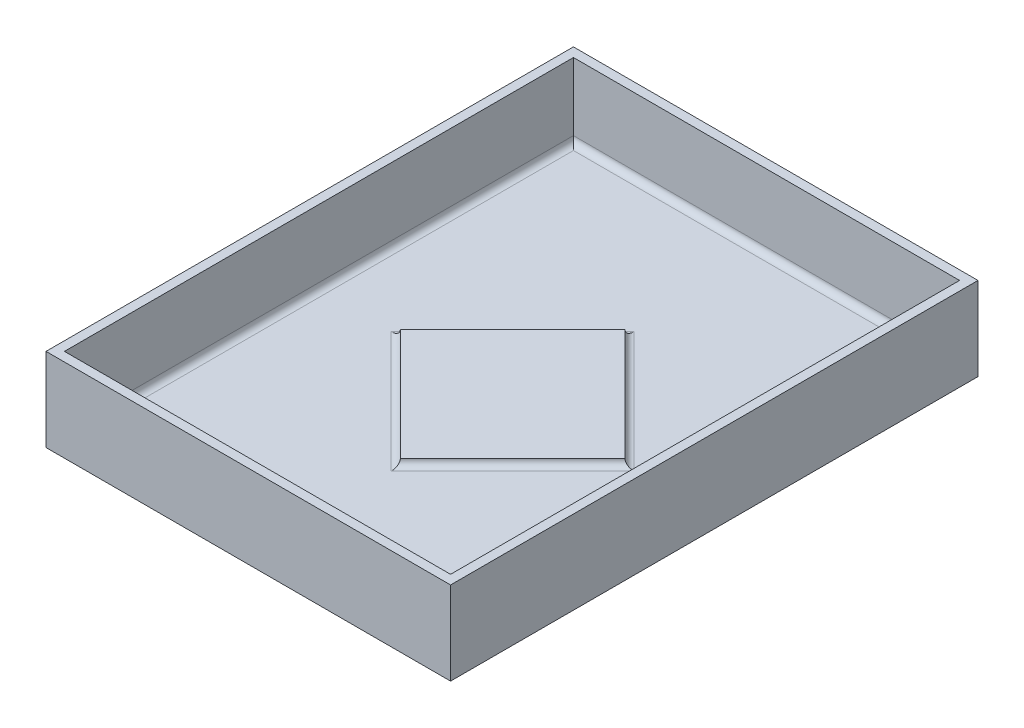
ISO-10303-21;
HEADER;
FILE_DESCRIPTION(('STEP AP214'),'2;1');
FILE_NAME('part.step','',(''),(''),'','','');
FILE_SCHEMA(('AUTOMOTIVE_DESIGN { 1 0 10303 214 1 1 1 1 }'));
ENDSEC;
DATA;
#1=APPLICATION_CONTEXT('core data for automotive mechanical design processes');
#2=APPLICATION_PROTOCOL_DEFINITION('international standard','automotive_design',2000,#1);
#3=PRODUCT_CONTEXT('',#1,'mechanical');
#4=PRODUCT('Part','Part','',(#3));
#5=PRODUCT_RELATED_PRODUCT_CATEGORY('part','',(#4));
#6=PRODUCT_DEFINITION_FORMATION('','',#4);
#7=PRODUCT_DEFINITION_CONTEXT('part definition',#1,'design');
#8=PRODUCT_DEFINITION('design','',#6,#7);
#9=PRODUCT_DEFINITION_SHAPE('','',#8);
#10=(LENGTH_UNIT() NAMED_UNIT(*) SI_UNIT(.MILLI.,.METRE.));
#11=(NAMED_UNIT(*) PLANE_ANGLE_UNIT() SI_UNIT($,.RADIAN.));
#12=(NAMED_UNIT(*) SI_UNIT($,.STERADIAN.) SOLID_ANGLE_UNIT());
#13=UNCERTAINTY_MEASURE_WITH_UNIT(LENGTH_MEASURE(1.E-05),#10,'distance_accuracy_value','');
#14=(GEOMETRIC_REPRESENTATION_CONTEXT(3) GLOBAL_UNCERTAINTY_ASSIGNED_CONTEXT((#13)) GLOBAL_UNIT_ASSIGNED_CONTEXT((#10,
#11,#12)) REPRESENTATION_CONTEXT('',''));
#15=CARTESIAN_POINT('',(0.,0.,0.));
#16=DIRECTION('',(0.,0.,1.));
#17=DIRECTION('',(1.,0.,0.));
#18=AXIS2_PLACEMENT_3D('',#15,#16,#17);
#19=CARTESIAN_POINT('',(0.,0.,0.));
#20=DIRECTION('',(0.,1.,0.));
#21=DIRECTION('',(0.,0.,1.));
#22=AXIS2_PLACEMENT_3D('',#19,#20,#21);
#23=PLANE('',#22);
#24=DIRECTION('',(-0.707106781186547,0.,-0.707106781186548));
#25=VECTOR('',#24,1.);
#26=CARTESIAN_POINT('',(309.126078517512,0.,-309.126078517512));
#27=LINE('',#26,#25);
#28=CARTESIAN_POINT('',(210.222102231989,0.,-408.030054803034));
#29=VERTEX_POINT('',#28);
#30=CARTESIAN_POINT('',(341.355054803034,0.,-276.897102231989));
#31=VERTEX_POINT('',#30);
#32=EDGE_CURVE('E242',#29,#31,#27,.F.);
#33=ORIENTED_EDGE('',*,*,#32,.T.);
#34=DIRECTION('',(0.707106781186547,0.,-0.707106781186548));
#35=VECTOR('',#34,1.);
#36=CARTESIAN_POINT('',(32.2289762855227,0.,32.2289762855226));
#37=LINE('',#36,#35);
#38=CARTESIAN_POINT('',(209.55,0.,-145.092047428955));
#39=VERTEX_POINT('',#38);
#40=EDGE_CURVE('E244',#31,#39,#37,.F.);
#41=ORIENTED_EDGE('',*,*,#40,.T.);
#42=DIRECTION('',(0.707106781186547,0.,0.707106781186548));
#43=VECTOR('',#42,1.);
#44=CARTESIAN_POINT('',(177.321023714477,0.,-177.321023714477));
#45=LINE('',#44,#43);
#46=CARTESIAN_POINT('',(78.4170474289547,0.,-276.225));
#47=VERTEX_POINT('',#46);
#48=EDGE_CURVE('E238',#39,#47,#45,.F.);
#49=ORIENTED_EDGE('',*,*,#48,.T.);
#50=DIRECTION('',(-0.707106781186547,0.,0.707106781186548));
#51=VECTOR('',#50,1.);
#52=CARTESIAN_POINT('',(-98.9039762855226,0.,-98.9039762855226));
#53=LINE('',#52,#51);
#54=EDGE_CURVE('E240',#47,#29,#53,.F.);
#55=ORIENTED_EDGE('',*,*,#54,.T.);
#56=EDGE_LOOP('',(#33,#41,#49,#55));
#57=FACE_BOUND('',#56,.T.);
#58=DIRECTION('',(1.,0.,0.));
#59=VECTOR('',#58,1.);
#60=CARTESIAN_POINT('',(419.1,0.,-7.));
#61=LINE('',#60,#59);
#62=CARTESIAN_POINT('',(7.,0.,-7.));
#63=VERTEX_POINT('',#62);
#64=CARTESIAN_POINT('',(412.1,0.,-7.));
#65=VERTEX_POINT('',#64);
#66=EDGE_CURVE('E233',#63,#65,#61,.T.);
#67=ORIENTED_EDGE('',*,*,#66,.T.);
#68=DIRECTION('',(0.,0.,-1.));
#69=VECTOR('',#68,1.);
#70=CARTESIAN_POINT('',(412.1,0.,-552.45));
#71=LINE('',#70,#69);
#72=CARTESIAN_POINT('',(412.1,0.,-545.45));
#73=VERTEX_POINT('',#72);
#74=EDGE_CURVE('E235',#65,#73,#71,.T.);
#75=ORIENTED_EDGE('',*,*,#74,.T.);
#76=DIRECTION('',(-1.,0.,0.));
#77=VECTOR('',#76,1.);
#78=CARTESIAN_POINT('',(0.,0.,-545.45));
#79=LINE('',#78,#77);
#80=CARTESIAN_POINT('',(7.,0.,-545.45));
#81=VERTEX_POINT('',#80);
#82=EDGE_CURVE('E229',#73,#81,#79,.T.);
#83=ORIENTED_EDGE('',*,*,#82,.T.);
#84=DIRECTION('',(0.,0.,1.));
#85=VECTOR('',#84,1.);
#86=CARTESIAN_POINT('',(7.,0.,0.));
#87=LINE('',#86,#85);
#88=EDGE_CURVE('E231',#81,#63,#87,.T.);
#89=ORIENTED_EDGE('',*,*,#88,.T.);
#90=EDGE_LOOP('',(#67,#75,#83,#89));
#91=FACE_BOUND('',#90,.T.);
#92=ADVANCED_FACE('F33',(#57,#91),#23,.T.);
#93=CARTESIAN_POINT('',(0.,80.42,0.));
#94=DIRECTION('',(0.,1.,0.));
#95=DIRECTION('',(0.,0.,1.));
#96=AXIS2_PLACEMENT_3D('',#93,#94,#95);
#97=PLANE('',#96);
#98=DIRECTION('',(0.,0.,1.));
#99=VECTOR('',#98,1.);
#100=CARTESIAN_POINT('',(-10.0000000000001,80.42,-562.45));
#101=LINE('',#100,#99);
#102=CARTESIAN_POINT('',(-10.0000000000001,80.42,-562.45));
#103=VERTEX_POINT('',#102);
#104=CARTESIAN_POINT('',(-10.,80.42,10.));
#105=VERTEX_POINT('',#104);
#106=EDGE_CURVE('E209',#103,#105,#101,.T.);
#107=ORIENTED_EDGE('',*,*,#106,.T.);
#108=DIRECTION('',(1.,0.,0.));
#109=VECTOR('',#108,1.);
#110=CARTESIAN_POINT('',(-10.,80.42,10.));
#111=LINE('',#110,#109);
#112=CARTESIAN_POINT('',(429.1,80.42,10.));
#113=VERTEX_POINT('',#112);
#114=EDGE_CURVE('E212',#105,#113,#111,.T.);
#115=ORIENTED_EDGE('',*,*,#114,.T.);
#116=DIRECTION('',(0.,0.,-1.));
#117=VECTOR('',#116,1.);
#118=CARTESIAN_POINT('',(429.1,80.42,-562.45));
#119=LINE('',#118,#117);
#120=CARTESIAN_POINT('',(429.1,80.42,-562.45));
#121=VERTEX_POINT('',#120);
#122=EDGE_CURVE('E214',#113,#121,#119,.T.);
#123=ORIENTED_EDGE('',*,*,#122,.T.);
#124=DIRECTION('',(-1.,0.,0.));
#125=VECTOR('',#124,1.);
#126=CARTESIAN_POINT('',(-10.0000000000001,80.42,-562.45));
#127=LINE('',#126,#125);
#128=EDGE_CURVE('E216',#121,#103,#127,.T.);
#129=ORIENTED_EDGE('',*,*,#128,.T.);
#130=EDGE_LOOP('',(#107,#115,#123,#129));
#131=FACE_BOUND('',#130,.T.);
#132=DIRECTION('',(1.,0.,0.));
#133=VECTOR('',#132,1.);
#134=CARTESIAN_POINT('',(0.,80.42,0.));
#135=LINE('',#134,#133);
#136=CARTESIAN_POINT('',(0.,80.42,0.));
#137=VERTEX_POINT('',#136);
#138=CARTESIAN_POINT('',(419.1,80.42,0.));
#139=VERTEX_POINT('',#138);
#140=EDGE_CURVE('E193',#137,#139,#135,.T.);
#141=ORIENTED_EDGE('',*,*,#140,.F.);
#142=DIRECTION('',(0.,0.,1.));
#143=VECTOR('',#142,1.);
#144=CARTESIAN_POINT('',(0.,80.42,-552.45));
#145=LINE('',#144,#143);
#146=CARTESIAN_POINT('',(0.,80.42,-552.45));
#147=VERTEX_POINT('',#146);
#148=EDGE_CURVE('E191',#147,#137,#145,.T.);
#149=ORIENTED_EDGE('',*,*,#148,.F.);
#150=DIRECTION('',(-1.,0.,0.));
#151=VECTOR('',#150,1.);
#152=CARTESIAN_POINT('',(0.,80.42,-552.45));
#153=LINE('',#152,#151);
#154=CARTESIAN_POINT('',(419.1,80.42,-552.45));
#155=VERTEX_POINT('',#154);
#156=EDGE_CURVE('E198',#155,#147,#153,.T.);
#157=ORIENTED_EDGE('',*,*,#156,.F.);
#158=DIRECTION('',(0.,0.,-1.));
#159=VECTOR('',#158,1.);
#160=CARTESIAN_POINT('',(419.1,80.42,-552.45));
#161=LINE('',#160,#159);
#162=EDGE_CURVE('E195',#139,#155,#161,.T.);
#163=ORIENTED_EDGE('',*,*,#162,.F.);
#164=EDGE_LOOP('',(#141,#149,#157,#163));
#165=FACE_BOUND('',#164,.T.);
#166=ADVANCED_FACE('F298',(#131,#165),#97,.T.);
#167=CARTESIAN_POINT('',(-10.0000000000001,80.42,-562.45));
#168=DIRECTION('',(1.,0.,0.));
#169=DIRECTION('',(0.,0.,-1.));
#170=AXIS2_PLACEMENT_3D('',#167,#168,#169);
#171=PLANE('',#170);
#172=DIRECTION('',(0.,-1.,0.));
#173=VECTOR('',#172,1.);
#174=CARTESIAN_POINT('',(-10.0000000000001,80.42,-562.45));
#175=LINE('',#174,#173);
#176=CARTESIAN_POINT('',(-10.0000000000001,-10.,-562.45));
#177=VERTEX_POINT('',#176);
#178=EDGE_CURVE('E218',#103,#177,#175,.T.);
#179=ORIENTED_EDGE('',*,*,#178,.T.);
#180=DIRECTION('',(0.,0.,1.));
#181=VECTOR('',#180,1.);
#182=CARTESIAN_POINT('',(-10.0000000000001,-10.,10.));
#183=LINE('',#182,#181);
#184=CARTESIAN_POINT('',(-10.0000000000001,-10.,10.));
#185=VERTEX_POINT('',#184);
#186=EDGE_CURVE('E185',#177,#185,#183,.T.);
#187=ORIENTED_EDGE('',*,*,#186,.T.);
#188=DIRECTION('',(0.,-1.,0.));
#189=VECTOR('',#188,1.);
#190=CARTESIAN_POINT('',(-10.,80.42,10.));
#191=LINE('',#190,#189);
#192=EDGE_CURVE('E224',#105,#185,#191,.T.);
#193=ORIENTED_EDGE('',*,*,#192,.F.);
#194=ORIENTED_EDGE('',*,*,#106,.F.);
#195=EDGE_LOOP('',(#179,#187,#193,#194));
#196=FACE_BOUND('',#195,.T.);
#197=ADVANCED_FACE('F304',(#196),#171,.F.);
#198=CARTESIAN_POINT('',(-10.,80.42,10.));
#199=DIRECTION('',(0.,0.,-1.));
#200=DIRECTION('',(-1.,0.,0.));
#201=AXIS2_PLACEMENT_3D('',#198,#199,#200);
#202=PLANE('',#201);
#203=ORIENTED_EDGE('',*,*,#192,.T.);
#204=DIRECTION('',(1.,0.,0.));
#205=VECTOR('',#204,1.);
#206=CARTESIAN_POINT('',(429.1,-10.,10.));
#207=LINE('',#206,#205);
#208=CARTESIAN_POINT('',(429.1,-10.,10.));
#209=VERTEX_POINT('',#208);
#210=EDGE_CURVE('E188',#185,#209,#207,.T.);
#211=ORIENTED_EDGE('',*,*,#210,.T.);
#212=DIRECTION('',(0.,-1.,0.));
#213=VECTOR('',#212,1.);
#214=CARTESIAN_POINT('',(429.1,80.42,10.));
#215=LINE('',#214,#213);
#216=EDGE_CURVE('E222',#113,#209,#215,.T.);
#217=ORIENTED_EDGE('',*,*,#216,.F.);
#218=ORIENTED_EDGE('',*,*,#114,.F.);
#219=EDGE_LOOP('',(#203,#211,#217,#218));
#220=FACE_BOUND('',#219,.T.);
#221=ADVANCED_FACE('F328',(#220),#202,.F.);
#222=CARTESIAN_POINT('',(429.1,80.42,-562.45));
#223=DIRECTION('',(-1.,0.,0.));
#224=DIRECTION('',(0.,0.,1.));
#225=AXIS2_PLACEMENT_3D('',#222,#223,#224);
#226=PLANE('',#225);
#227=ORIENTED_EDGE('',*,*,#216,.T.);
#228=DIRECTION('',(0.,0.,-1.));
#229=VECTOR('',#228,1.);
#230=CARTESIAN_POINT('',(429.1,-10.,10.));
#231=LINE('',#230,#229);
#232=CARTESIAN_POINT('',(429.1,-10.,-562.45));
#233=VERTEX_POINT('',#232);
#234=EDGE_CURVE('E174',#209,#233,#231,.T.);
#235=ORIENTED_EDGE('',*,*,#234,.T.);
#236=DIRECTION('',(0.,-1.,0.));
#237=VECTOR('',#236,1.);
#238=CARTESIAN_POINT('',(429.1,80.42,-562.45));
#239=LINE('',#238,#237);
#240=EDGE_CURVE('E220',#121,#233,#239,.T.);
#241=ORIENTED_EDGE('',*,*,#240,.F.);
#242=ORIENTED_EDGE('',*,*,#122,.F.);
#243=EDGE_LOOP('',(#227,#235,#241,#242));
#244=FACE_BOUND('',#243,.T.);
#245=ADVANCED_FACE('F324',(#244),#226,.F.);
#246=CARTESIAN_POINT('',(-10.0000000000001,80.42,-562.45));
#247=DIRECTION('',(0.,0.,1.));
#248=DIRECTION('',(1.,0.,0.));
#249=AXIS2_PLACEMENT_3D('',#246,#247,#248);
#250=PLANE('',#249);
#251=ORIENTED_EDGE('',*,*,#240,.T.);
#252=DIRECTION('',(-1.,0.,0.));
#253=VECTOR('',#252,1.);
#254=CARTESIAN_POINT('',(429.1,-10.,-562.45));
#255=LINE('',#254,#253);
#256=EDGE_CURVE('E177',#233,#177,#255,.T.);
#257=ORIENTED_EDGE('',*,*,#256,.T.);
#258=ORIENTED_EDGE('',*,*,#178,.F.);
#259=ORIENTED_EDGE('',*,*,#128,.F.);
#260=EDGE_LOOP('',(#251,#257,#258,#259));
#261=FACE_BOUND('',#260,.T.);
#262=ADVANCED_FACE('F320',(#261),#250,.F.);
#263=CARTESIAN_POINT('',(0.,80.42,-552.45));
#264=DIRECTION('',(1.,0.,0.));
#265=DIRECTION('',(0.,0.,-1.));
#266=AXIS2_PLACEMENT_3D('',#263,#264,#265);
#267=PLANE('',#266);
#268=DIRECTION('',(0.,-1.,0.));
#269=VECTOR('',#268,1.);
#270=CARTESIAN_POINT('',(0.,80.42,0.));
#271=LINE('',#270,#269);
#272=CARTESIAN_POINT('',(0.,6.99999999999999,0.));
#273=VERTEX_POINT('',#272);
#274=EDGE_CURVE('E207',#137,#273,#271,.T.);
#275=ORIENTED_EDGE('',*,*,#274,.T.);
#276=DIRECTION('',(0.,0.,1.));
#277=VECTOR('',#276,1.);
#278=CARTESIAN_POINT('',(0.,7.,-552.45));
#279=LINE('',#278,#277);
#280=CARTESIAN_POINT('',(0.,6.99999999999999,-552.45));
#281=VERTEX_POINT('',#280);
#282=EDGE_CURVE('E42',#273,#281,#279,.F.);
#283=ORIENTED_EDGE('',*,*,#282,.T.);
#284=DIRECTION('',(0.,-1.,0.));
#285=VECTOR('',#284,1.);
#286=CARTESIAN_POINT('',(0.,80.42,-552.45));
#287=LINE('',#286,#285);
#288=EDGE_CURVE('E200',#147,#281,#287,.T.);
#289=ORIENTED_EDGE('',*,*,#288,.F.);
#290=ORIENTED_EDGE('',*,*,#148,.T.);
#291=EDGE_LOOP('',(#275,#283,#289,#290));
#292=FACE_BOUND('',#291,.T.);
#293=ADVANCED_FACE('F318',(#292),#267,.T.);
#294=CARTESIAN_POINT('',(0.,80.42,0.));
#295=DIRECTION('',(0.,0.,-1.));
#296=DIRECTION('',(-1.,0.,0.));
#297=AXIS2_PLACEMENT_3D('',#294,#295,#296);
#298=PLANE('',#297);
#299=DIRECTION('',(0.,-1.,0.));
#300=VECTOR('',#299,1.);
#301=CARTESIAN_POINT('',(419.1,80.42,0.));
#302=LINE('',#301,#300);
#303=CARTESIAN_POINT('',(419.1,6.99999999999999,0.));
#304=VERTEX_POINT('',#303);
#305=EDGE_CURVE('E205',#139,#304,#302,.T.);
#306=ORIENTED_EDGE('',*,*,#305,.T.);
#307=DIRECTION('',(1.,0.,0.));
#308=VECTOR('',#307,1.);
#309=CARTESIAN_POINT('',(0.,7.,0.));
#310=LINE('',#309,#308);
#311=EDGE_CURVE('E57',#304,#273,#310,.F.);
#312=ORIENTED_EDGE('',*,*,#311,.T.);
#313=ORIENTED_EDGE('',*,*,#274,.F.);
#314=ORIENTED_EDGE('',*,*,#140,.T.);
#315=EDGE_LOOP('',(#306,#312,#313,#314));
#316=FACE_BOUND('',#315,.T.);
#317=ADVANCED_FACE('F315',(#316),#298,.T.);
#318=CARTESIAN_POINT('',(419.1,80.42,-552.45));
#319=DIRECTION('',(-1.,0.,0.));
#320=DIRECTION('',(0.,0.,1.));
#321=AXIS2_PLACEMENT_3D('',#318,#319,#320);
#322=PLANE('',#321);
#323=DIRECTION('',(0.,-1.,0.));
#324=VECTOR('',#323,1.);
#325=CARTESIAN_POINT('',(419.1,80.42,-552.45));
#326=LINE('',#325,#324);
#327=CARTESIAN_POINT('',(419.1,6.99999999999999,-552.45));
#328=VERTEX_POINT('',#327);
#329=EDGE_CURVE('E202',#155,#328,#326,.T.);
#330=ORIENTED_EDGE('',*,*,#329,.T.);
#331=DIRECTION('',(0.,0.,-1.));
#332=VECTOR('',#331,1.);
#333=CARTESIAN_POINT('',(419.1,7.,0.));
#334=LINE('',#333,#332);
#335=EDGE_CURVE('E252',#328,#304,#334,.F.);
#336=ORIENTED_EDGE('',*,*,#335,.T.);
#337=ORIENTED_EDGE('',*,*,#305,.F.);
#338=ORIENTED_EDGE('',*,*,#162,.T.);
#339=EDGE_LOOP('',(#330,#336,#337,#338));
#340=FACE_BOUND('',#339,.T.);
#341=ADVANCED_FACE('F289',(#340),#322,.T.);
#342=CARTESIAN_POINT('',(0.,80.42,-552.45));
#343=DIRECTION('',(0.,0.,1.));
#344=DIRECTION('',(1.,0.,0.));
#345=AXIS2_PLACEMENT_3D('',#342,#343,#344);
#346=PLANE('',#345);
#347=ORIENTED_EDGE('',*,*,#288,.T.);
#348=DIRECTION('',(-1.,0.,0.));
#349=VECTOR('',#348,1.);
#350=CARTESIAN_POINT('',(419.1,7.,-552.45));
#351=LINE('',#350,#349);
#352=EDGE_CURVE('E11',#281,#328,#351,.F.);
#353=ORIENTED_EDGE('',*,*,#352,.T.);
#354=ORIENTED_EDGE('',*,*,#329,.F.);
#355=ORIENTED_EDGE('',*,*,#156,.T.);
#356=EDGE_LOOP('',(#347,#353,#354,#355));
#357=FACE_BOUND('',#356,.T.);
#358=ADVANCED_FACE('F286',(#357),#346,.T.);
#359=CARTESIAN_POINT('',(0.,-10.,0.));
#360=DIRECTION('',(0.,1.,0.));
#361=DIRECTION('',(0.,0.,1.));
#362=AXIS2_PLACEMENT_3D('',#359,#360,#361);
#363=PLANE('',#362);
#364=ORIENTED_EDGE('',*,*,#234,.F.);
#365=ORIENTED_EDGE('',*,*,#210,.F.);
#366=ORIENTED_EDGE('',*,*,#186,.F.);
#367=ORIENTED_EDGE('',*,*,#256,.F.);
#368=EDGE_LOOP('',(#364,#365,#366,#367));
#369=FACE_BOUND('',#368,.T.);
#370=ADVANCED_FACE('F309',(#369),#363,.F.);
#371=CARTESIAN_POINT('',(88.3165423655664,7.16,-276.225));
#372=DIRECTION('',(0.707106781186548,0.,0.707106781186547));
#373=DIRECTION('',(0.707106781186547,0.,-0.707106781186548));
#374=AXIS2_PLACEMENT_3D('',#371,#372,#373);
#375=PLANE('',#374);
#376=DIRECTION('',(0.,-1.,0.));
#377=VECTOR('',#376,1.);
#378=CARTESIAN_POINT('',(210.222102231989,7.16,-398.130559866423));
#379=LINE('',#378,#377);
#380=CARTESIAN_POINT('',(210.222102231989,7.16,-398.130559866423));
#381=VERTEX_POINT('',#380);
#382=CARTESIAN_POINT('',(210.222102231989,7.,-398.130559866423));
#383=VERTEX_POINT('',#382);
#384=EDGE_CURVE('E551',#381,#383,#379,.T.);
#385=ORIENTED_EDGE('',*,*,#384,.T.);
#386=DIRECTION('',(-0.707106781186547,0.,0.707106781186548));
#387=VECTOR('',#386,1.);
#388=CARTESIAN_POINT('',(88.3165423655664,7.,-276.225));
#389=LINE('',#388,#387);
#390=CARTESIAN_POINT('',(88.3165423655664,7.,-276.225));
#391=VERTEX_POINT('',#390);
#392=EDGE_CURVE('E173',#383,#391,#389,.T.);
#393=ORIENTED_EDGE('',*,*,#392,.T.);
#394=DIRECTION('',(0.,-1.,0.));
#395=VECTOR('',#394,1.);
#396=CARTESIAN_POINT('',(88.3165423655664,7.16,-276.225));
#397=LINE('',#396,#395);
#398=CARTESIAN_POINT('',(88.3165423655664,7.16,-276.225));
#399=VERTEX_POINT('',#398);
#400=EDGE_CURVE('E153',#399,#391,#397,.T.);
#401=ORIENTED_EDGE('',*,*,#400,.F.);
#402=DIRECTION('',(-0.707106781186547,0.,0.707106781186548));
#403=VECTOR('',#402,1.);
#404=CARTESIAN_POINT('',(88.3165423655664,7.16,-276.225));
#405=LINE('',#404,#403);
#406=EDGE_CURVE('E160',#381,#399,#405,.T.);
#407=ORIENTED_EDGE('',*,*,#406,.F.);
#408=EDGE_LOOP('',(#385,#393,#401,#407));
#409=FACE_BOUND('',#408,.T.);
#410=ADVANCED_FACE('F171',(#409),#375,.F.);
#411=CARTESIAN_POINT('',(88.3165423655664,7.16,-276.225));
#412=DIRECTION('',(0.707106781186548,0.,-0.707106781186547));
#413=DIRECTION('',(-0.707106781186547,0.,-0.707106781186548));
#414=AXIS2_PLACEMENT_3D('',#411,#412,#413);
#415=PLANE('',#414);
#416=ORIENTED_EDGE('',*,*,#400,.T.);
#417=DIRECTION('',(0.707106781186547,0.,0.707106781186548));
#418=VECTOR('',#417,1.);
#419=CARTESIAN_POINT('',(88.3165423655664,7.,-276.225));
#420=LINE('',#419,#418);
#421=CARTESIAN_POINT('',(209.55,7.,-154.991542365566));
#422=VERTEX_POINT('',#421);
#423=EDGE_CURVE('E250',#391,#422,#420,.T.);
#424=ORIENTED_EDGE('',*,*,#423,.T.);
#425=DIRECTION('',(0.,-1.,0.));
#426=VECTOR('',#425,1.);
#427=CARTESIAN_POINT('',(209.55,7.16,-154.991542365566));
#428=LINE('',#427,#426);
#429=CARTESIAN_POINT('',(209.55,7.16,-154.991542365566));
#430=VERTEX_POINT('',#429);
#431=EDGE_CURVE('E156',#430,#422,#428,.T.);
#432=ORIENTED_EDGE('',*,*,#431,.F.);
#433=DIRECTION('',(0.707106781186547,0.,0.707106781186548));
#434=VECTOR('',#433,1.);
#435=CARTESIAN_POINT('',(88.3165423655664,7.16,-276.225));
#436=LINE('',#435,#434);
#437=EDGE_CURVE('E149',#399,#430,#436,.T.);
#438=ORIENTED_EDGE('',*,*,#437,.F.);
#439=EDGE_LOOP('',(#416,#424,#432,#438));
#440=FACE_BOUND('',#439,.T.);
#441=ADVANCED_FACE('F151',(#440),#415,.F.);
#442=CARTESIAN_POINT('',(209.55,7.16,-154.991542365566));
#443=DIRECTION('',(-0.707106781186548,0.,-0.707106781186547));
#444=DIRECTION('',(-0.707106781186547,0.,0.707106781186548));
#445=AXIS2_PLACEMENT_3D('',#442,#443,#444);
#446=PLANE('',#445);
#447=ORIENTED_EDGE('',*,*,#431,.T.);
#448=DIRECTION('',(0.707106781186547,0.,-0.707106781186548));
#449=VECTOR('',#448,1.);
#450=CARTESIAN_POINT('',(209.55,7.,-154.991542365566));
#451=LINE('',#450,#449);
#452=CARTESIAN_POINT('',(331.455559866423,7.,-276.897102231989));
#453=VERTEX_POINT('',#452);
#454=EDGE_CURVE('E226',#422,#453,#451,.T.);
#455=ORIENTED_EDGE('',*,*,#454,.T.);
#456=DIRECTION('',(0.,-1.,0.));
#457=VECTOR('',#456,1.);
#458=CARTESIAN_POINT('',(331.455559866423,7.16,-276.897102231989));
#459=LINE('',#458,#457);
#460=CARTESIAN_POINT('',(331.455559866423,7.16,-276.897102231989));
#461=VERTEX_POINT('',#460);
#462=EDGE_CURVE('E179',#461,#453,#459,.T.);
#463=ORIENTED_EDGE('',*,*,#462,.F.);
#464=DIRECTION('',(0.707106781186547,0.,-0.707106781186548));
#465=VECTOR('',#464,1.);
#466=CARTESIAN_POINT('',(209.55,7.16,-154.991542365566));
#467=LINE('',#466,#465);
#468=EDGE_CURVE('E159',#430,#461,#467,.T.);
#469=ORIENTED_EDGE('',*,*,#468,.F.);
#470=EDGE_LOOP('',(#447,#455,#463,#469));
#471=FACE_BOUND('',#470,.T.);
#472=ADVANCED_FACE('F391',(#471),#446,.F.);
#473=CARTESIAN_POINT('',(210.222102231989,7.16,-398.130559866423));
#474=DIRECTION('',(-0.707106781186548,0.,0.707106781186547));
#475=DIRECTION('',(0.707106781186547,0.,0.707106781186548));
#476=AXIS2_PLACEMENT_3D('',#473,#474,#475);
#477=PLANE('',#476);
#478=ORIENTED_EDGE('',*,*,#462,.T.);
#479=DIRECTION('',(-0.707106781186547,0.,-0.707106781186548));
#480=VECTOR('',#479,1.);
#481=CARTESIAN_POINT('',(210.222102231989,7.,-398.130559866423));
#482=LINE('',#481,#480);
#483=EDGE_CURVE('E247',#453,#383,#482,.T.);
#484=ORIENTED_EDGE('',*,*,#483,.T.);
#485=ORIENTED_EDGE('',*,*,#384,.F.);
#486=DIRECTION('',(-0.707106781186547,0.,-0.707106781186548));
#487=VECTOR('',#486,1.);
#488=CARTESIAN_POINT('',(210.222102231989,7.16,-398.130559866423));
#489=LINE('',#488,#487);
#490=EDGE_CURVE('E165',#461,#381,#489,.T.);
#491=ORIENTED_EDGE('',*,*,#490,.F.);
#492=EDGE_LOOP('',(#478,#484,#485,#491));
#493=FACE_BOUND('',#492,.T.);
#494=ADVANCED_FACE('F384',(#493),#477,.F.);
#495=CARTESIAN_POINT('',(0.,7.16,0.));
#496=DIRECTION('',(0.,-1.,0.));
#497=DIRECTION('',(0.,0.,-1.));
#498=AXIS2_PLACEMENT_3D('',#495,#496,#497);
#499=PLANE('',#498);
#500=ORIENTED_EDGE('',*,*,#406,.T.);
#501=ORIENTED_EDGE('',*,*,#437,.T.);
#502=ORIENTED_EDGE('',*,*,#468,.T.);
#503=ORIENTED_EDGE('',*,*,#490,.T.);
#504=EDGE_LOOP('',(#500,#501,#502,#503));
#505=FACE_BOUND('',#504,.T.);
#506=ADVANCED_FACE('F163',(#505),#499,.F.);
#507=CARTESIAN_POINT('',(83.3667948972606,7.,-281.174747468306));
#508=DIRECTION('',(-0.707106781186547,0.,0.707106781186548));
#509=DIRECTION('',(0.707106781186548,0.,0.707106781186547));
#510=AXIS2_PLACEMENT_3D('',#507,#508,#509);
#511=CYLINDRICAL_SURFACE('',#510,7.);
#512=CARTESIAN_POINT('',(210.222102231989,7.,-408.030054803034));
#513=DIRECTION('',(-1.,0.,0.));
#514=DIRECTION('',(0.,0.,1.));
#515=AXIS2_PLACEMENT_3D('',#512,#513,#514);
#516=ELLIPSE('',#515,9.89949493661167,7.);
#517=EDGE_CURVE('E261',#29,#383,#516,.T.);
#518=ORIENTED_EDGE('',*,*,#517,.F.);
#519=ORIENTED_EDGE('',*,*,#54,.F.);
#520=CARTESIAN_POINT('',(78.4170474289547,7.,-276.225));
#521=DIRECTION('',(0.,0.,1.));
#522=DIRECTION('',(1.,0.,0.));
#523=AXIS2_PLACEMENT_3D('',#520,#521,#522);
#524=ELLIPSE('',#523,9.89949493661166,7.);
#525=EDGE_CURVE('E169',#391,#47,#524,.F.);
#526=ORIENTED_EDGE('',*,*,#525,.F.);
#527=ORIENTED_EDGE('',*,*,#392,.F.);
#528=EDGE_LOOP('',(#518,#519,#526,#527));
#529=FACE_BOUND('',#528,.T.);
#530=ADVANCED_FACE('F347',(#529),#511,.F.);
#531=CARTESIAN_POINT('',(83.3667948972606,7.,-271.275252531694));
#532=DIRECTION('',(0.707106781186547,0.,0.707106781186548));
#533=DIRECTION('',(0.707106781186548,0.,-0.707106781186547));
#534=AXIS2_PLACEMENT_3D('',#531,#532,#533);
#535=CYLINDRICAL_SURFACE('',#534,7.);
#536=ORIENTED_EDGE('',*,*,#525,.T.);
#537=ORIENTED_EDGE('',*,*,#48,.F.);
#538=CARTESIAN_POINT('',(209.55,7.,-145.092047428955));
#539=DIRECTION('',(1.,0.,0.));
#540=DIRECTION('',(0.,0.,1.));
#541=AXIS2_PLACEMENT_3D('',#538,#539,#540);
#542=ELLIPSE('',#541,9.89949493661167,7.);
#543=EDGE_CURVE('E259',#422,#39,#542,.F.);
#544=ORIENTED_EDGE('',*,*,#543,.F.);
#545=ORIENTED_EDGE('',*,*,#423,.F.);
#546=EDGE_LOOP('',(#536,#537,#544,#545));
#547=FACE_BOUND('',#546,.T.);
#548=ADVANCED_FACE('F343',(#547),#535,.F.);
#549=CARTESIAN_POINT('',(215.171849700295,7.,-403.080307334729));
#550=DIRECTION('',(-0.707106781186547,0.,-0.707106781186548));
#551=DIRECTION('',(-0.707106781186548,0.,0.707106781186547));
#552=AXIS2_PLACEMENT_3D('',#549,#550,#551);
#553=CYLINDRICAL_SURFACE('',#552,7.);
#554=ORIENTED_EDGE('',*,*,#517,.T.);
#555=ORIENTED_EDGE('',*,*,#483,.F.);
#556=CARTESIAN_POINT('',(341.355054803034,7.,-276.897102231989));
#557=DIRECTION('',(0.,0.,-1.));
#558=DIRECTION('',(-1.,0.,0.));
#559=AXIS2_PLACEMENT_3D('',#556,#557,#558);
#560=ELLIPSE('',#559,9.89949493661166,7.);
#561=EDGE_CURVE('E257',#31,#453,#560,.T.);
#562=ORIENTED_EDGE('',*,*,#561,.F.);
#563=ORIENTED_EDGE('',*,*,#32,.F.);
#564=EDGE_LOOP('',(#554,#555,#562,#563));
#565=FACE_BOUND('',#564,.T.);
#566=ADVANCED_FACE('F339',(#565),#553,.F.);
#567=CARTESIAN_POINT('',(214.499747468306,7.,-150.041794897261));
#568=DIRECTION('',(0.707106781186547,0.,-0.707106781186548));
#569=DIRECTION('',(-0.707106781186548,0.,-0.707106781186547));
#570=AXIS2_PLACEMENT_3D('',#567,#568,#569);
#571=CYLINDRICAL_SURFACE('',#570,7.);
#572=ORIENTED_EDGE('',*,*,#543,.T.);
#573=ORIENTED_EDGE('',*,*,#40,.F.);
#574=ORIENTED_EDGE('',*,*,#561,.T.);
#575=ORIENTED_EDGE('',*,*,#454,.F.);
#576=EDGE_LOOP('',(#572,#573,#574,#575));
#577=FACE_BOUND('',#576,.T.);
#578=ADVANCED_FACE('F336',(#577),#571,.F.);
#579=CARTESIAN_POINT('',(7.,7.,0.));
#580=DIRECTION('',(0.,0.,-1.));
#581=DIRECTION('',(-1.,0.,0.));
#582=AXIS2_PLACEMENT_3D('',#579,#580,#581);
#583=CYLINDRICAL_SURFACE('',#582,7.);
#584=CARTESIAN_POINT('',(7.,7.,-545.45));
#585=DIRECTION('',(0.707106781186547,0.,-0.707106781186547));
#586=DIRECTION('',(-0.707106781186547,0.,-0.707106781186547));
#587=AXIS2_PLACEMENT_3D('',#584,#585,#586);
#588=ELLIPSE('',#587,9.89949493661167,7.);
#589=EDGE_CURVE('E269',#281,#81,#588,.F.);
#590=ORIENTED_EDGE('',*,*,#589,.F.);
#591=ORIENTED_EDGE('',*,*,#282,.F.);
#592=CARTESIAN_POINT('',(7.,7.,-7.));
#593=DIRECTION('',(-0.707106781186547,0.,-0.707106781186547));
#594=DIRECTION('',(-0.707106781186547,0.,0.707106781186547));
#595=AXIS2_PLACEMENT_3D('',#592,#593,#594);
#596=ELLIPSE('',#595,9.89949493661167,7.);
#597=EDGE_CURVE('E37',#63,#273,#596,.T.);
#598=ORIENTED_EDGE('',*,*,#597,.F.);
#599=ORIENTED_EDGE('',*,*,#88,.F.);
#600=EDGE_LOOP('',(#590,#591,#598,#599));
#601=FACE_BOUND('',#600,.T.);
#602=ADVANCED_FACE('F35',(#601),#583,.F.);
#603=CARTESIAN_POINT('',(0.,7.,-7.));
#604=DIRECTION('',(-1.,0.,0.));
#605=DIRECTION('',(0.,0.,1.));
#606=AXIS2_PLACEMENT_3D('',#603,#604,#605);
#607=CYLINDRICAL_SURFACE('',#606,7.);
#608=ORIENTED_EDGE('',*,*,#597,.T.);
#609=ORIENTED_EDGE('',*,*,#311,.F.);
#610=CARTESIAN_POINT('',(412.1,7.,-7.));
#611=DIRECTION('',(-0.707106781186547,0.,0.707106781186547));
#612=DIRECTION('',(0.707106781186547,0.,0.707106781186547));
#613=AXIS2_PLACEMENT_3D('',#610,#611,#612);
#614=ELLIPSE('',#613,9.89949493661167,7.);
#615=EDGE_CURVE('E268',#65,#304,#614,.T.);
#616=ORIENTED_EDGE('',*,*,#615,.F.);
#617=ORIENTED_EDGE('',*,*,#66,.F.);
#618=EDGE_LOOP('',(#608,#609,#616,#617));
#619=FACE_BOUND('',#618,.T.);
#620=ADVANCED_FACE('F279',(#619),#607,.F.);
#621=CARTESIAN_POINT('',(0.,7.,-545.45));
#622=DIRECTION('',(1.,0.,0.));
#623=DIRECTION('',(0.,0.,-1.));
#624=AXIS2_PLACEMENT_3D('',#621,#622,#623);
#625=CYLINDRICAL_SURFACE('',#624,7.);
#626=ORIENTED_EDGE('',*,*,#589,.T.);
#627=ORIENTED_EDGE('',*,*,#82,.F.);
#628=CARTESIAN_POINT('',(412.1,7.,-545.45));
#629=DIRECTION('',(0.707106781186547,0.,0.707106781186547));
#630=DIRECTION('',(-0.707106781186547,0.,0.707106781186547));
#631=AXIS2_PLACEMENT_3D('',#628,#629,#630);
#632=ELLIPSE('',#631,9.89949493661167,7.);
#633=EDGE_CURVE('E266',#328,#73,#632,.F.);
#634=ORIENTED_EDGE('',*,*,#633,.F.);
#635=ORIENTED_EDGE('',*,*,#352,.F.);
#636=EDGE_LOOP('',(#626,#627,#634,#635));
#637=FACE_BOUND('',#636,.T.);
#638=ADVANCED_FACE('F284',(#637),#625,.F.);
#639=CARTESIAN_POINT('',(412.1,7.,0.));
#640=DIRECTION('',(0.,0.,1.));
#641=DIRECTION('',(1.,0.,0.));
#642=AXIS2_PLACEMENT_3D('',#639,#640,#641);
#643=CYLINDRICAL_SURFACE('',#642,7.);
#644=ORIENTED_EDGE('',*,*,#615,.T.);
#645=ORIENTED_EDGE('',*,*,#335,.F.);
#646=ORIENTED_EDGE('',*,*,#633,.T.);
#647=ORIENTED_EDGE('',*,*,#74,.F.);
#648=EDGE_LOOP('',(#644,#645,#646,#647));
#649=FACE_BOUND('',#648,.T.);
#650=ADVANCED_FACE('F294',(#649),#643,.F.);
#651=CLOSED_SHELL('',(#92,#166,#197,#221,#245,#262,#293,#317,#341,#358,#370,#410,#441,#472,#494,
#506,#530,#548,#566,#578,#602,#620,#638,#650));
#652=MANIFOLD_SOLID_BREP('B2',#651);
#653=ADVANCED_BREP_SHAPE_REPRESENTATION('',(#18,#652),#14);
#654=SHAPE_DEFINITION_REPRESENTATION(#9,#653);
ENDSEC;
END-ISO-10303-21;
